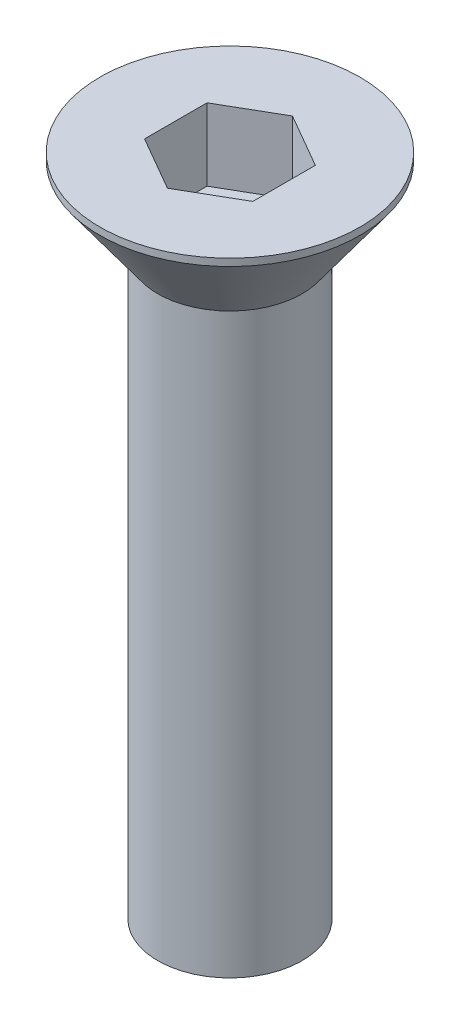
ISO-10303-21;
HEADER;
FILE_DESCRIPTION(('STEP AP214'),'2;1');
FILE_NAME('part.step','',(''),(''),'','','');
FILE_SCHEMA(('AUTOMOTIVE_DESIGN { 1 0 10303 214 1 1 1 1 }'));
ENDSEC;
DATA;
#1=APPLICATION_CONTEXT('core data for automotive mechanical design processes');
#2=APPLICATION_PROTOCOL_DEFINITION('international standard','automotive_design',2000,#1);
#3=PRODUCT_CONTEXT('',#1,'mechanical');
#4=PRODUCT('Part','Part','',(#3));
#5=PRODUCT_RELATED_PRODUCT_CATEGORY('part','',(#4));
#6=PRODUCT_DEFINITION_FORMATION('','',#4);
#7=PRODUCT_DEFINITION_CONTEXT('part definition',#1,'design');
#8=PRODUCT_DEFINITION('design','',#6,#7);
#9=PRODUCT_DEFINITION_SHAPE('','',#8);
#10=(LENGTH_UNIT() NAMED_UNIT(*) SI_UNIT(.MILLI.,.METRE.));
#11=(NAMED_UNIT(*) PLANE_ANGLE_UNIT() SI_UNIT($,.RADIAN.));
#12=(NAMED_UNIT(*) SI_UNIT($,.STERADIAN.) SOLID_ANGLE_UNIT());
#13=UNCERTAINTY_MEASURE_WITH_UNIT(LENGTH_MEASURE(1.E-05),#10,'distance_accuracy_value','');
#14=(GEOMETRIC_REPRESENTATION_CONTEXT(3) GLOBAL_UNCERTAINTY_ASSIGNED_CONTEXT((#13)) GLOBAL_UNIT_ASSIGNED_CONTEXT((#10,
#11,#12)) REPRESENTATION_CONTEXT('',''));
#15=CARTESIAN_POINT('',(0.,0.,0.));
#16=DIRECTION('',(0.,0.,1.));
#17=DIRECTION('',(1.,0.,0.));
#18=AXIS2_PLACEMENT_3D('',#15,#16,#17);
#19=CARTESIAN_POINT('',(0.,-0.1,0.));
#20=DIRECTION('',(0.,1.,0.));
#21=DIRECTION('',(0.,0.,1.));
#22=AXIS2_PLACEMENT_3D('',#19,#20,#21);
#23=CONICAL_SURFACE('',#22,1.8,0.628796286415433);
#24=CARTESIAN_POINT('',(0.,-1.2,0.));
#25=DIRECTION('',(0.,-1.,0.));
#26=DIRECTION('',(0.,0.,-1.));
#27=AXIS2_PLACEMENT_3D('',#24,#25,#26);
#28=CIRCLE('',#27,1.);
#29=CARTESIAN_POINT('',(0.,-1.2,-1.));
#30=VERTEX_POINT('',#29);
#31=EDGE_CURVE('E11',#30,#30,#28,.T.);
#32=ORIENTED_EDGE('',*,*,#31,.F.);
#33=EDGE_LOOP('',(#32));
#34=FACE_BOUND('',#33,.T.);
#35=CARTESIAN_POINT('',(0.,-0.1,0.));
#36=DIRECTION('',(0.,-1.,0.));
#37=DIRECTION('',(0.,0.,-1.));
#38=AXIS2_PLACEMENT_3D('',#35,#36,#37);
#39=CIRCLE('',#38,1.8);
#40=CARTESIAN_POINT('',(0.,-0.1,-1.8));
#41=VERTEX_POINT('',#40);
#42=EDGE_CURVE('E54',#41,#41,#39,.T.);
#43=ORIENTED_EDGE('',*,*,#42,.T.);
#44=EDGE_LOOP('',(#43));
#45=FACE_BOUND('',#44,.T.);
#46=ADVANCED_FACE('F47',(#34,#45),#23,.T.);
#47=CARTESIAN_POINT('',(0.,0.,0.));
#48=DIRECTION('',(0.,-1.,0.));
#49=DIRECTION('',(0.,0.,-1.));
#50=AXIS2_PLACEMENT_3D('',#47,#48,#49);
#51=CYLINDRICAL_SURFACE('',#50,1.8);
#52=ORIENTED_EDGE('',*,*,#42,.F.);
#53=EDGE_LOOP('',(#52));
#54=FACE_BOUND('',#53,.T.);
#55=CARTESIAN_POINT('',(0.,0.,0.));
#56=DIRECTION('',(0.,-1.,0.));
#57=DIRECTION('',(0.,0.,-1.));
#58=AXIS2_PLACEMENT_3D('',#55,#56,#57);
#59=CIRCLE('',#58,1.8);
#60=CARTESIAN_POINT('',(0.,0.,-1.8));
#61=VERTEX_POINT('',#60);
#62=EDGE_CURVE('E149',#61,#61,#59,.T.);
#63=ORIENTED_EDGE('',*,*,#62,.T.);
#64=EDGE_LOOP('',(#63));
#65=FACE_BOUND('',#64,.T.);
#66=ADVANCED_FACE('F160',(#54,#65),#51,.T.);
#67=CARTESIAN_POINT('',(0.,0.,0.));
#68=DIRECTION('',(0.,-1.,0.));
#69=DIRECTION('',(0.,0.,-1.));
#70=AXIS2_PLACEMENT_3D('',#67,#68,#69);
#71=PLANE('',#70);
#72=DIRECTION('',(0.866025403784438,0.,-0.5));
#73=VECTOR('',#72,1.);
#74=CARTESIAN_POINT('',(0.,0.,0.866025403784439));
#75=LINE('',#74,#73);
#76=CARTESIAN_POINT('',(0.,0.,0.866025403784439));
#77=VERTEX_POINT('',#76);
#78=CARTESIAN_POINT('',(0.75,0.,0.433012701892219));
#79=VERTEX_POINT('',#78);
#80=EDGE_CURVE('E135',#77,#79,#75,.T.);
#81=ORIENTED_EDGE('',*,*,#80,.F.);
#82=DIRECTION('',(0.866025403784439,0.,0.5));
#83=VECTOR('',#82,1.);
#84=CARTESIAN_POINT('',(-0.75,0.,0.433012701892219));
#85=LINE('',#84,#83);
#86=CARTESIAN_POINT('',(-0.75,0.,0.433012701892219));
#87=VERTEX_POINT('',#86);
#88=EDGE_CURVE('E61',#87,#77,#85,.T.);
#89=ORIENTED_EDGE('',*,*,#88,.F.);
#90=DIRECTION('',(0.,0.,1.));
#91=VECTOR('',#90,1.);
#92=CARTESIAN_POINT('',(-0.75,0.,-0.433012701892219));
#93=LINE('',#92,#91);
#94=CARTESIAN_POINT('',(-0.75,0.,-0.433012701892219));
#95=VERTEX_POINT('',#94);
#96=EDGE_CURVE('E145',#95,#87,#93,.T.);
#97=ORIENTED_EDGE('',*,*,#96,.F.);
#98=DIRECTION('',(-0.866025403784439,0.,0.5));
#99=VECTOR('',#98,1.);
#100=CARTESIAN_POINT('',(0.,0.,-0.866025403784439));
#101=LINE('',#100,#99);
#102=CARTESIAN_POINT('',(0.,0.,-0.866025403784439));
#103=VERTEX_POINT('',#102);
#104=EDGE_CURVE('E143',#103,#95,#101,.T.);
#105=ORIENTED_EDGE('',*,*,#104,.F.);
#106=DIRECTION('',(-0.866025403784439,0.,-0.5));
#107=VECTOR('',#106,1.);
#108=CARTESIAN_POINT('',(0.75,0.,-0.43301270189222));
#109=LINE('',#108,#107);
#110=CARTESIAN_POINT('',(0.75,0.,-0.43301270189222));
#111=VERTEX_POINT('',#110);
#112=EDGE_CURVE('E109',#111,#103,#109,.T.);
#113=ORIENTED_EDGE('',*,*,#112,.F.);
#114=DIRECTION('',(0.,0.,-1.));
#115=VECTOR('',#114,1.);
#116=CARTESIAN_POINT('',(0.75,0.,0.433012701892219));
#117=LINE('',#116,#115);
#118=EDGE_CURVE('E139',#79,#111,#117,.T.);
#119=ORIENTED_EDGE('',*,*,#118,.F.);
#120=EDGE_LOOP('',(#81,#89,#97,#105,#113,#119));
#121=FACE_BOUND('',#120,.T.);
#122=ORIENTED_EDGE('',*,*,#62,.F.);
#123=EDGE_LOOP('',(#122));
#124=FACE_BOUND('',#123,.T.);
#125=ADVANCED_FACE('F163',(#121,#124),#71,.F.);
#126=CARTESIAN_POINT('',(-0.75,-1.,0.433012701892219));
#127=DIRECTION('',(-0.5,0.,0.866025403784439));
#128=DIRECTION('',(0.866025403784439,0.,0.5));
#129=AXIS2_PLACEMENT_3D('',#126,#127,#128);
#130=PLANE('',#129);
#131=ORIENTED_EDGE('',*,*,#88,.T.);
#132=DIRECTION('',(0.,1.,0.));
#133=VECTOR('',#132,1.);
#134=CARTESIAN_POINT('',(0.,-1.,0.866025403784439));
#135=LINE('',#134,#133);
#136=CARTESIAN_POINT('',(0.,-1.,0.866025403784439));
#137=VERTEX_POINT('',#136);
#138=EDGE_CURVE('E91',#137,#77,#135,.T.);
#139=ORIENTED_EDGE('',*,*,#138,.F.);
#140=DIRECTION('',(0.866025403784439,0.,0.5));
#141=VECTOR('',#140,1.);
#142=CARTESIAN_POINT('',(-0.75,-1.,0.433012701892219));
#143=LINE('',#142,#141);
#144=CARTESIAN_POINT('',(-0.75,-1.,0.433012701892219));
#145=VERTEX_POINT('',#144);
#146=EDGE_CURVE('E147',#145,#137,#143,.T.);
#147=ORIENTED_EDGE('',*,*,#146,.F.);
#148=DIRECTION('',(0.,1.,0.));
#149=VECTOR('',#148,1.);
#150=CARTESIAN_POINT('',(-0.75,-1.,0.433012701892219));
#151=LINE('',#150,#149);
#152=EDGE_CURVE('E69',#145,#87,#151,.T.);
#153=ORIENTED_EDGE('',*,*,#152,.T.);
#154=EDGE_LOOP('',(#131,#139,#147,#153));
#155=FACE_BOUND('',#154,.T.);
#156=ADVANCED_FACE('F167',(#155),#130,.F.);
#157=CARTESIAN_POINT('',(-0.75,-1.,-0.433012701892219));
#158=DIRECTION('',(-1.,0.,0.));
#159=DIRECTION('',(0.,0.,1.));
#160=AXIS2_PLACEMENT_3D('',#157,#158,#159);
#161=PLANE('',#160);
#162=ORIENTED_EDGE('',*,*,#96,.T.);
#163=ORIENTED_EDGE('',*,*,#152,.F.);
#164=DIRECTION('',(0.,0.,1.));
#165=VECTOR('',#164,1.);
#166=CARTESIAN_POINT('',(-0.75,-1.,-0.433012701892219));
#167=LINE('',#166,#165);
#168=CARTESIAN_POINT('',(-0.75,-1.,-0.433012701892219));
#169=VERTEX_POINT('',#168);
#170=EDGE_CURVE('E121',#169,#145,#167,.T.);
#171=ORIENTED_EDGE('',*,*,#170,.F.);
#172=DIRECTION('',(0.,1.,0.));
#173=VECTOR('',#172,1.);
#174=CARTESIAN_POINT('',(-0.75,-1.,-0.433012701892219));
#175=LINE('',#174,#173);
#176=EDGE_CURVE('E113',#169,#95,#175,.T.);
#177=ORIENTED_EDGE('',*,*,#176,.T.);
#178=EDGE_LOOP('',(#162,#163,#171,#177));
#179=FACE_BOUND('',#178,.T.);
#180=ADVANCED_FACE('F173',(#179),#161,.F.);
#181=CARTESIAN_POINT('',(0.,-1.,-0.866025403784439));
#182=DIRECTION('',(-0.5,0.,-0.866025403784439));
#183=DIRECTION('',(-0.866025403784439,0.,0.5));
#184=AXIS2_PLACEMENT_3D('',#181,#182,#183);
#185=PLANE('',#184);
#186=ORIENTED_EDGE('',*,*,#104,.T.);
#187=ORIENTED_EDGE('',*,*,#176,.F.);
#188=DIRECTION('',(-0.866025403784439,0.,0.5));
#189=VECTOR('',#188,1.);
#190=CARTESIAN_POINT('',(0.,-1.,-0.866025403784439));
#191=LINE('',#190,#189);
#192=CARTESIAN_POINT('',(0.,-1.,-0.866025403784439));
#193=VERTEX_POINT('',#192);
#194=EDGE_CURVE('E117',#193,#169,#191,.T.);
#195=ORIENTED_EDGE('',*,*,#194,.F.);
#196=DIRECTION('',(0.,1.,0.));
#197=VECTOR('',#196,1.);
#198=CARTESIAN_POINT('',(0.,-1.,-0.866025403784439));
#199=LINE('',#198,#197);
#200=EDGE_CURVE('E102',#193,#103,#199,.T.);
#201=ORIENTED_EDGE('',*,*,#200,.T.);
#202=EDGE_LOOP('',(#186,#187,#195,#201));
#203=FACE_BOUND('',#202,.T.);
#204=ADVANCED_FACE('F118',(#203),#185,.F.);
#205=CARTESIAN_POINT('',(0.75,-1.,-0.43301270189222));
#206=DIRECTION('',(0.5,0.,-0.866025403784439));
#207=DIRECTION('',(-0.866025403784439,0.,-0.5));
#208=AXIS2_PLACEMENT_3D('',#205,#206,#207);
#209=PLANE('',#208);
#210=ORIENTED_EDGE('',*,*,#112,.T.);
#211=ORIENTED_EDGE('',*,*,#200,.F.);
#212=DIRECTION('',(-0.866025403784439,0.,-0.5));
#213=VECTOR('',#212,1.);
#214=CARTESIAN_POINT('',(0.75,-1.,-0.43301270189222));
#215=LINE('',#214,#213);
#216=CARTESIAN_POINT('',(0.75,-1.,-0.43301270189222));
#217=VERTEX_POINT('',#216);
#218=EDGE_CURVE('E106',#217,#193,#215,.T.);
#219=ORIENTED_EDGE('',*,*,#218,.F.);
#220=DIRECTION('',(0.,1.,0.));
#221=VECTOR('',#220,1.);
#222=CARTESIAN_POINT('',(0.75,-1.,-0.43301270189222));
#223=LINE('',#222,#221);
#224=EDGE_CURVE('E114',#217,#111,#223,.T.);
#225=ORIENTED_EDGE('',*,*,#224,.T.);
#226=EDGE_LOOP('',(#210,#211,#219,#225));
#227=FACE_BOUND('',#226,.T.);
#228=ADVANCED_FACE('F104',(#227),#209,.F.);
#229=CARTESIAN_POINT('',(0.75,-1.,0.433012701892219));
#230=DIRECTION('',(1.,0.,0.));
#231=DIRECTION('',(0.,0.,-1.));
#232=AXIS2_PLACEMENT_3D('',#229,#230,#231);
#233=PLANE('',#232);
#234=ORIENTED_EDGE('',*,*,#118,.T.);
#235=ORIENTED_EDGE('',*,*,#224,.F.);
#236=DIRECTION('',(0.,0.,-1.));
#237=VECTOR('',#236,1.);
#238=CARTESIAN_POINT('',(0.75,-1.,0.433012701892219));
#239=LINE('',#238,#237);
#240=CARTESIAN_POINT('',(0.75,-1.,0.433012701892219));
#241=VERTEX_POINT('',#240);
#242=EDGE_CURVE('E127',#241,#217,#239,.T.);
#243=ORIENTED_EDGE('',*,*,#242,.F.);
#244=DIRECTION('',(0.,1.,0.));
#245=VECTOR('',#244,1.);
#246=CARTESIAN_POINT('',(0.75,-1.,0.433012701892219));
#247=LINE('',#246,#245);
#248=EDGE_CURVE('E152',#241,#79,#247,.T.);
#249=ORIENTED_EDGE('',*,*,#248,.T.);
#250=EDGE_LOOP('',(#234,#235,#243,#249));
#251=FACE_BOUND('',#250,.T.);
#252=ADVANCED_FACE('F203',(#251),#233,.F.);
#253=CARTESIAN_POINT('',(0.,-1.,0.866025403784439));
#254=DIRECTION('',(0.5,0.,0.866025403784438));
#255=DIRECTION('',(0.866025403784439,0.,-0.5));
#256=AXIS2_PLACEMENT_3D('',#253,#254,#255);
#257=PLANE('',#256);
#258=ORIENTED_EDGE('',*,*,#80,.T.);
#259=ORIENTED_EDGE('',*,*,#248,.F.);
#260=DIRECTION('',(0.866025403784438,0.,-0.5));
#261=VECTOR('',#260,1.);
#262=CARTESIAN_POINT('',(0.,-1.,0.866025403784439));
#263=LINE('',#262,#261);
#264=EDGE_CURVE('E129',#137,#241,#263,.T.);
#265=ORIENTED_EDGE('',*,*,#264,.F.);
#266=ORIENTED_EDGE('',*,*,#138,.T.);
#267=EDGE_LOOP('',(#258,#259,#265,#266));
#268=FACE_BOUND('',#267,.T.);
#269=ADVANCED_FACE('F193',(#268),#257,.F.);
#270=CARTESIAN_POINT('',(0.,-1.,0.));
#271=DIRECTION('',(0.,1.,0.));
#272=DIRECTION('',(0.,0.,1.));
#273=AXIS2_PLACEMENT_3D('',#270,#271,#272);
#274=PLANE('',#273);
#275=ORIENTED_EDGE('',*,*,#146,.T.);
#276=ORIENTED_EDGE('',*,*,#264,.T.);
#277=ORIENTED_EDGE('',*,*,#242,.T.);
#278=ORIENTED_EDGE('',*,*,#218,.T.);
#279=ORIENTED_EDGE('',*,*,#194,.T.);
#280=ORIENTED_EDGE('',*,*,#170,.T.);
#281=EDGE_LOOP('',(#275,#276,#277,#278,#279,#280));
#282=FACE_BOUND('',#281,.T.);
#283=ADVANCED_FACE('F124',(#282),#274,.T.);
#284=CARTESIAN_POINT('',(0.,-9.2,0.));
#285=DIRECTION('',(0.,1.,0.));
#286=DIRECTION('',(0.,0.,1.));
#287=AXIS2_PLACEMENT_3D('',#284,#285,#286);
#288=CYLINDRICAL_SURFACE('',#287,1.);
#289=CARTESIAN_POINT('',(0.,-9.2,0.));
#290=DIRECTION('',(0.,-1.,0.));
#291=DIRECTION('',(0.,0.,-1.));
#292=AXIS2_PLACEMENT_3D('',#289,#290,#291);
#293=CIRCLE('',#292,1.);
#294=CARTESIAN_POINT('',(0.,-9.2,-1.));
#295=VERTEX_POINT('',#294);
#296=EDGE_CURVE('E136',#295,#295,#293,.T.);
#297=ORIENTED_EDGE('',*,*,#296,.F.);
#298=EDGE_LOOP('',(#297));
#299=FACE_BOUND('',#298,.T.);
#300=ORIENTED_EDGE('',*,*,#31,.T.);
#301=EDGE_LOOP('',(#300));
#302=FACE_BOUND('',#301,.T.);
#303=ADVANCED_FACE('F182',(#299,#302),#288,.T.);
#304=CARTESIAN_POINT('',(0.,-9.2,0.));
#305=DIRECTION('',(0.,-1.,0.));
#306=DIRECTION('',(0.,0.,-1.));
#307=AXIS2_PLACEMENT_3D('',#304,#305,#306);
#308=PLANE('',#307);
#309=ORIENTED_EDGE('',*,*,#296,.T.);
#310=EDGE_LOOP('',(#309));
#311=FACE_BOUND('',#310,.T.);
#312=ADVANCED_FACE('F184',(#311),#308,.T.);
#313=CLOSED_SHELL('',(#46,#66,#125,#156,#180,#204,#228,#252,#269,#283,#303,#312));
#314=MANIFOLD_SOLID_BREP('B2',#313);
#315=ADVANCED_BREP_SHAPE_REPRESENTATION('',(#18,#314),#14);
#316=SHAPE_DEFINITION_REPRESENTATION(#9,#315);
ENDSEC;
END-ISO-10303-21;
